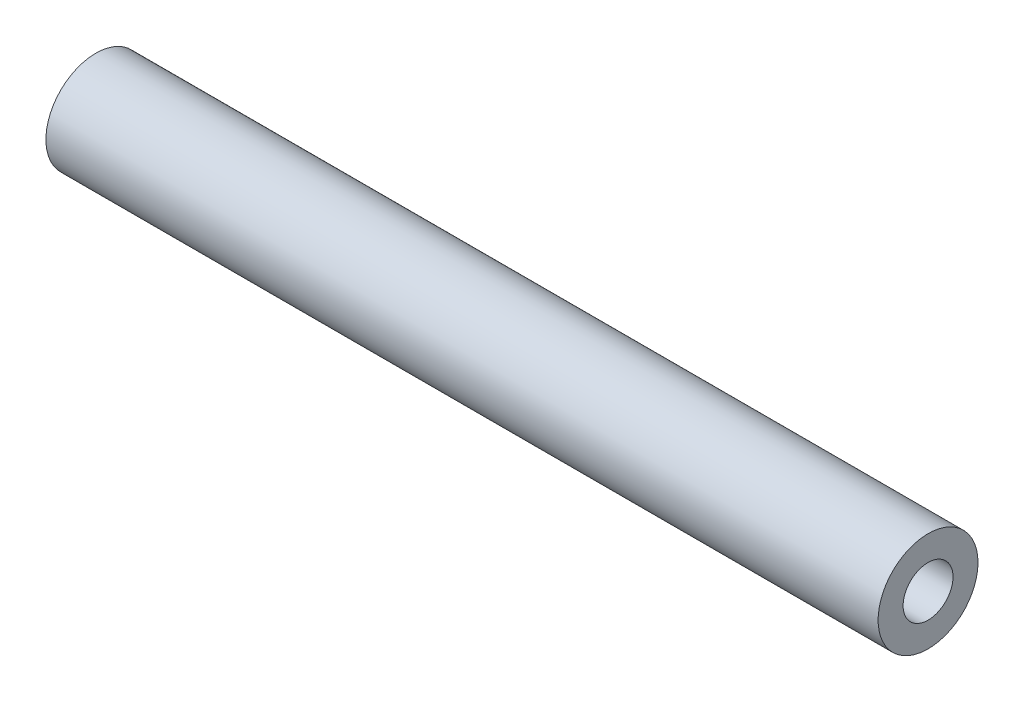
ISO-10303-21;
HEADER;
FILE_DESCRIPTION(('STEP AP214'),'2;1');
FILE_NAME('part.step','',(''),(''),'','','');
FILE_SCHEMA(('AUTOMOTIVE_DESIGN { 1 0 10303 214 1 1 1 1 }'));
ENDSEC;
DATA;
#1=APPLICATION_CONTEXT('core data for automotive mechanical design processes');
#2=APPLICATION_PROTOCOL_DEFINITION('international standard','automotive_design',2000,#1);
#3=PRODUCT_CONTEXT('',#1,'mechanical');
#4=PRODUCT('Part','Part','',(#3));
#5=PRODUCT_RELATED_PRODUCT_CATEGORY('part','',(#4));
#6=PRODUCT_DEFINITION_FORMATION('','',#4);
#7=PRODUCT_DEFINITION_CONTEXT('part definition',#1,'design');
#8=PRODUCT_DEFINITION('design','',#6,#7);
#9=PRODUCT_DEFINITION_SHAPE('','',#8);
#10=(LENGTH_UNIT() NAMED_UNIT(*) SI_UNIT(.MILLI.,.METRE.));
#11=(NAMED_UNIT(*) PLANE_ANGLE_UNIT() SI_UNIT($,.RADIAN.));
#12=(NAMED_UNIT(*) SI_UNIT($,.STERADIAN.) SOLID_ANGLE_UNIT());
#13=UNCERTAINTY_MEASURE_WITH_UNIT(LENGTH_MEASURE(1.E-05),#10,'distance_accuracy_value','');
#14=(GEOMETRIC_REPRESENTATION_CONTEXT(3) GLOBAL_UNCERTAINTY_ASSIGNED_CONTEXT((#13)) GLOBAL_UNIT_ASSIGNED_CONTEXT((#10,
#11,#12)) REPRESENTATION_CONTEXT('',''));
#15=CARTESIAN_POINT('',(0.,0.,0.));
#16=DIRECTION('',(0.,0.,1.));
#17=DIRECTION('',(1.,0.,0.));
#18=AXIS2_PLACEMENT_3D('',#15,#16,#17);
#19=CARTESIAN_POINT('',(100.,0.,0.));
#20=DIRECTION('',(-1.,0.,0.));
#21=DIRECTION('',(0.,0.,1.));
#22=AXIS2_PLACEMENT_3D('',#19,#20,#21);
#23=CYLINDRICAL_SURFACE('',#22,6.);
#24=CARTESIAN_POINT('',(100.,0.,0.));
#25=DIRECTION('',(1.,0.,0.));
#26=DIRECTION('',(0.,0.,-1.));
#27=AXIS2_PLACEMENT_3D('',#24,#25,#26);
#28=CIRCLE('',#27,6.);
#29=CARTESIAN_POINT('',(100.,0.,-6.));
#30=VERTEX_POINT('',#29);
#31=EDGE_CURVE('E10',#30,#30,#28,.T.);
#32=ORIENTED_EDGE('',*,*,#31,.F.);
#33=EDGE_LOOP('',(#32));
#34=FACE_BOUND('',#33,.T.);
#35=CARTESIAN_POINT('',(0.,0.,0.));
#36=DIRECTION('',(1.,0.,0.));
#37=DIRECTION('',(0.,0.,-1.));
#38=AXIS2_PLACEMENT_3D('',#35,#36,#37);
#39=CIRCLE('',#38,6.);
#40=CARTESIAN_POINT('',(0.,0.,-6.));
#41=VERTEX_POINT('',#40);
#42=EDGE_CURVE('E34',#41,#41,#39,.T.);
#43=ORIENTED_EDGE('',*,*,#42,.T.);
#44=EDGE_LOOP('',(#43));
#45=FACE_BOUND('',#44,.T.);
#46=ADVANCED_FACE('F31',(#34,#45),#23,.T.);
#47=CARTESIAN_POINT('',(100.,0.,0.));
#48=DIRECTION('',(1.,0.,0.));
#49=DIRECTION('',(0.,0.,-1.));
#50=AXIS2_PLACEMENT_3D('',#47,#48,#49);
#51=PLANE('',#50);
#52=CARTESIAN_POINT('',(100.,0.,0.));
#53=DIRECTION('',(1.,0.,0.));
#54=DIRECTION('',(0.,0.,-1.));
#55=AXIS2_PLACEMENT_3D('',#52,#53,#54);
#56=CIRCLE('',#55,3.);
#57=CARTESIAN_POINT('',(100.,0.,-3.));
#58=VERTEX_POINT('',#57);
#59=EDGE_CURVE('E43',#58,#58,#56,.T.);
#60=ORIENTED_EDGE('',*,*,#59,.F.);
#61=EDGE_LOOP('',(#60));
#62=FACE_BOUND('',#61,.T.);
#63=ORIENTED_EDGE('',*,*,#31,.T.);
#64=EDGE_LOOP('',(#63));
#65=FACE_BOUND('',#64,.T.);
#66=ADVANCED_FACE('F68',(#62,#65),#51,.T.);
#67=CARTESIAN_POINT('',(0.,0.,0.));
#68=DIRECTION('',(1.,0.,0.));
#69=DIRECTION('',(0.,0.,-1.));
#70=AXIS2_PLACEMENT_3D('',#67,#68,#69);
#71=PLANE('',#70);
#72=CARTESIAN_POINT('',(0.,0.,0.));
#73=DIRECTION('',(-1.,0.,0.));
#74=DIRECTION('',(0.,0.,1.));
#75=AXIS2_PLACEMENT_3D('',#72,#73,#74);
#76=CIRCLE('',#75,3.);
#77=CARTESIAN_POINT('',(0.,0.,3.));
#78=VERTEX_POINT('',#77);
#79=EDGE_CURVE('E49',#78,#78,#76,.T.);
#80=ORIENTED_EDGE('',*,*,#79,.F.);
#81=EDGE_LOOP('',(#80));
#82=FACE_BOUND('',#81,.T.);
#83=ORIENTED_EDGE('',*,*,#42,.F.);
#84=EDGE_LOOP('',(#83));
#85=FACE_BOUND('',#84,.T.);
#86=ADVANCED_FACE('F64',(#82,#85),#71,.F.);
#87=CARTESIAN_POINT('',(70.,0.,0.));
#88=DIRECTION('',(1.,0.,0.));
#89=DIRECTION('',(0.,0.,-1.));
#90=AXIS2_PLACEMENT_3D('',#87,#88,#89);
#91=CYLINDRICAL_SURFACE('',#90,3.);
#92=CARTESIAN_POINT('',(70.,0.,0.));
#93=DIRECTION('',(1.,0.,0.));
#94=DIRECTION('',(0.,0.,-1.));
#95=AXIS2_PLACEMENT_3D('',#92,#93,#94);
#96=CIRCLE('',#95,3.);
#97=CARTESIAN_POINT('',(70.,0.,-3.));
#98=VERTEX_POINT('',#97);
#99=EDGE_CURVE('E41',#98,#98,#96,.T.);
#100=ORIENTED_EDGE('',*,*,#99,.F.);
#101=EDGE_LOOP('',(#100));
#102=FACE_BOUND('',#101,.T.);
#103=ORIENTED_EDGE('',*,*,#59,.T.);
#104=EDGE_LOOP('',(#103));
#105=FACE_BOUND('',#104,.T.);
#106=ADVANCED_FACE('F67',(#102,#105),#91,.F.);
#107=CARTESIAN_POINT('',(70.,0.,0.));
#108=DIRECTION('',(1.,0.,0.));
#109=DIRECTION('',(0.,0.,-1.));
#110=AXIS2_PLACEMENT_3D('',#107,#108,#109);
#111=PLANE('',#110);
#112=ORIENTED_EDGE('',*,*,#99,.T.);
#113=EDGE_LOOP('',(#112));
#114=FACE_BOUND('',#113,.T.);
#115=ADVANCED_FACE('F60',(#114),#111,.T.);
#116=CARTESIAN_POINT('',(60.,0.,0.));
#117=DIRECTION('',(-1.,0.,0.));
#118=DIRECTION('',(0.,0.,1.));
#119=AXIS2_PLACEMENT_3D('',#116,#117,#118);
#120=CYLINDRICAL_SURFACE('',#119,3.);
#121=CARTESIAN_POINT('',(60.,0.,0.));
#122=DIRECTION('',(-1.,0.,0.));
#123=DIRECTION('',(0.,0.,1.));
#124=AXIS2_PLACEMENT_3D('',#121,#122,#123);
#125=CIRCLE('',#124,3.);
#126=CARTESIAN_POINT('',(60.,0.,3.));
#127=VERTEX_POINT('',#126);
#128=EDGE_CURVE('E46',#127,#127,#125,.T.);
#129=ORIENTED_EDGE('',*,*,#128,.F.);
#130=EDGE_LOOP('',(#129));
#131=FACE_BOUND('',#130,.T.);
#132=ORIENTED_EDGE('',*,*,#79,.T.);
#133=EDGE_LOOP('',(#132));
#134=FACE_BOUND('',#133,.T.);
#135=ADVANCED_FACE('F57',(#131,#134),#120,.F.);
#136=CARTESIAN_POINT('',(60.,0.,0.));
#137=DIRECTION('',(-1.,0.,0.));
#138=DIRECTION('',(0.,0.,1.));
#139=AXIS2_PLACEMENT_3D('',#136,#137,#138);
#140=PLANE('',#139);
#141=ORIENTED_EDGE('',*,*,#128,.T.);
#142=EDGE_LOOP('',(#141));
#143=FACE_BOUND('',#142,.T.);
#144=ADVANCED_FACE('F55',(#143),#140,.T.);
#145=CLOSED_SHELL('',(#46,#66,#86,#106,#115,#135,#144));
#146=MANIFOLD_SOLID_BREP('B2',#145);
#147=ADVANCED_BREP_SHAPE_REPRESENTATION('',(#18,#146),#14);
#148=SHAPE_DEFINITION_REPRESENTATION(#9,#147);
ENDSEC;
END-ISO-10303-21;
